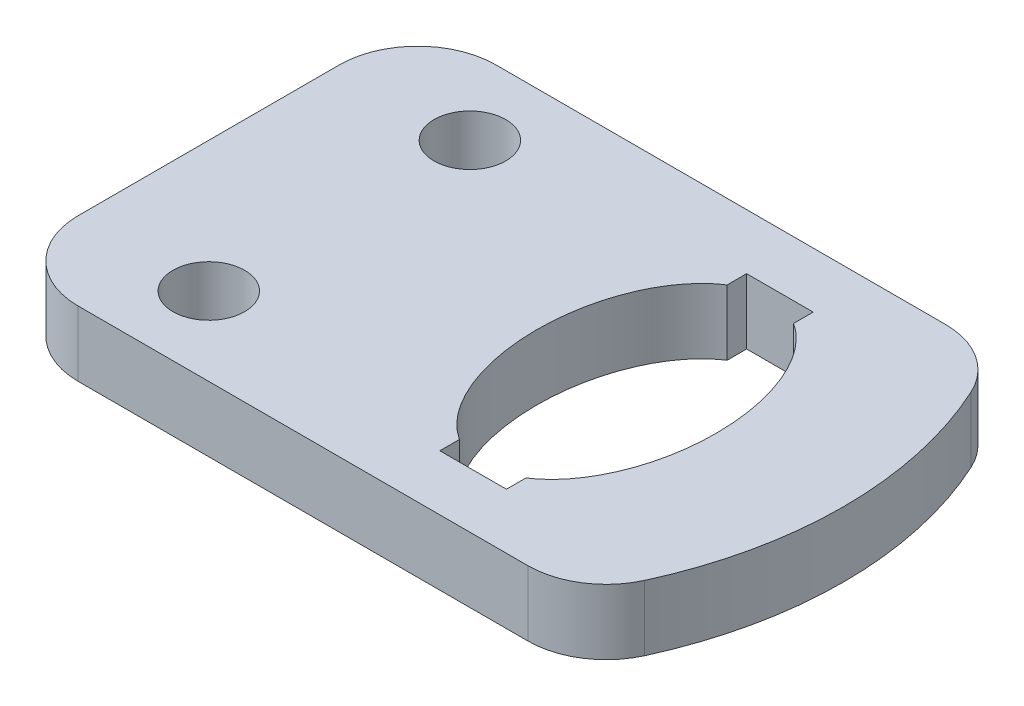
ISO-10303-21;
HEADER;
FILE_DESCRIPTION(('STEP AP214'),'2;1');
FILE_NAME('part.step','',(''),(''),'','','');
FILE_SCHEMA(('AUTOMOTIVE_DESIGN { 1 0 10303 214 1 1 1 1 }'));
ENDSEC;
DATA;
#1=APPLICATION_CONTEXT('core data for automotive mechanical design processes');
#2=APPLICATION_PROTOCOL_DEFINITION('international standard','automotive_design',2000,#1);
#3=PRODUCT_CONTEXT('',#1,'mechanical');
#4=PRODUCT('Part','Part','',(#3));
#5=PRODUCT_RELATED_PRODUCT_CATEGORY('part','',(#4));
#6=PRODUCT_DEFINITION_FORMATION('','',#4);
#7=PRODUCT_DEFINITION_CONTEXT('part definition',#1,'design');
#8=PRODUCT_DEFINITION('design','',#6,#7);
#9=PRODUCT_DEFINITION_SHAPE('','',#8);
#10=(LENGTH_UNIT() NAMED_UNIT(*) SI_UNIT(.MILLI.,.METRE.));
#11=(NAMED_UNIT(*) PLANE_ANGLE_UNIT() SI_UNIT($,.RADIAN.));
#12=(NAMED_UNIT(*) SI_UNIT($,.STERADIAN.) SOLID_ANGLE_UNIT());
#13=UNCERTAINTY_MEASURE_WITH_UNIT(LENGTH_MEASURE(1.E-05),#10,'distance_accuracy_value','');
#14=(GEOMETRIC_REPRESENTATION_CONTEXT(3) GLOBAL_UNCERTAINTY_ASSIGNED_CONTEXT((#13)) GLOBAL_UNIT_ASSIGNED_CONTEXT((#10,
#11,#12)) REPRESENTATION_CONTEXT('',''));
#15=CARTESIAN_POINT('',(0.,0.,0.));
#16=DIRECTION('',(0.,0.,1.));
#17=DIRECTION('',(1.,0.,0.));
#18=AXIS2_PLACEMENT_3D('',#15,#16,#17);
#19=CARTESIAN_POINT('',(44.,0.,32.));
#20=DIRECTION('',(0.,-1.,0.));
#21=DIRECTION('',(1.,0.,0.));
#22=AXIS2_PLACEMENT_3D('',#19,#20,#21);
#23=PLANE('',#22);
#24=CARTESIAN_POINT('',(10.,0.,6.));
#25=DIRECTION('',(0.,-1.,0.));
#26=DIRECTION('',(1.,0.,0.));
#27=AXIS2_PLACEMENT_3D('',#24,#25,#26);
#28=CIRCLE('',#27,2.75);
#29=CARTESIAN_POINT('',(12.75,0.,6.));
#30=VERTEX_POINT('',#29);
#31=EDGE_CURVE('E295',#30,#30,#28,.T.);
#32=ORIENTED_EDGE('',*,*,#31,.T.);
#33=EDGE_LOOP('',(#32));
#34=FACE_BOUND('',#33,.T.);
#35=CARTESIAN_POINT('',(10.,0.,26.));
#36=DIRECTION('',(0.,-1.,0.));
#37=DIRECTION('',(1.,0.,0.));
#38=AXIS2_PLACEMENT_3D('',#35,#36,#37);
#39=CIRCLE('',#38,2.75);
#40=CARTESIAN_POINT('',(12.75,0.,26.));
#41=VERTEX_POINT('',#40);
#42=EDGE_CURVE('E300',#41,#41,#39,.T.);
#43=ORIENTED_EDGE('',*,*,#42,.T.);
#44=EDGE_LOOP('',(#43));
#45=FACE_BOUND('',#44,.T.);
#46=DIRECTION('',(-1.,0.,0.));
#47=VECTOR('',#46,1.);
#48=CARTESIAN_POINT('',(29.45,0.,27.75));
#49=LINE('',#48,#47);
#50=CARTESIAN_POINT('',(34.55,0.,27.75));
#51=VERTEX_POINT('',#50);
#52=CARTESIAN_POINT('',(29.45,0.,27.75));
#53=VERTEX_POINT('',#52);
#54=EDGE_CURVE('E159',#51,#53,#49,.T.);
#55=ORIENTED_EDGE('',*,*,#54,.T.);
#56=DIRECTION('',(0.,0.,-1.));
#57=VECTOR('',#56,1.);
#58=CARTESIAN_POINT('',(29.45,0.,27.75));
#59=LINE('',#58,#57);
#60=CARTESIAN_POINT('',(29.45,0.,26.25));
#61=VERTEX_POINT('',#60);
#62=EDGE_CURVE('E151',#53,#61,#59,.T.);
#63=ORIENTED_EDGE('',*,*,#62,.T.);
#64=CARTESIAN_POINT('',(32.,0.,16.));
#65=DIRECTION('',(0.,-1.,0.));
#66=DIRECTION('',(0.,0.,1.));
#67=AXIS2_PLACEMENT_3D('',#64,#65,#66);
#68=ELLIPSE('',#67,11.0372996308849,6.87500000000001);
#69=CARTESIAN_POINT('',(29.45,0.,5.75));
#70=VERTEX_POINT('',#69);
#71=EDGE_CURVE('E163',#61,#70,#68,.T.);
#72=ORIENTED_EDGE('',*,*,#71,.T.);
#73=DIRECTION('',(0.,0.,-1.));
#74=VECTOR('',#73,1.);
#75=CARTESIAN_POINT('',(29.45,0.,5.75));
#76=LINE('',#75,#74);
#77=CARTESIAN_POINT('',(29.45,0.,4.25));
#78=VERTEX_POINT('',#77);
#79=EDGE_CURVE('E167',#70,#78,#76,.T.);
#80=ORIENTED_EDGE('',*,*,#79,.T.);
#81=DIRECTION('',(1.,0.,0.));
#82=VECTOR('',#81,1.);
#83=CARTESIAN_POINT('',(29.45,0.,4.25));
#84=LINE('',#83,#82);
#85=CARTESIAN_POINT('',(34.55,0.,4.25));
#86=VERTEX_POINT('',#85);
#87=EDGE_CURVE('E345',#78,#86,#84,.T.);
#88=ORIENTED_EDGE('',*,*,#87,.T.);
#89=DIRECTION('',(0.,0.,1.));
#90=VECTOR('',#89,1.);
#91=CARTESIAN_POINT('',(34.55,0.,5.75));
#92=LINE('',#91,#90);
#93=CARTESIAN_POINT('',(34.55,0.,5.74999999999999));
#94=VERTEX_POINT('',#93);
#95=EDGE_CURVE('E346',#86,#94,#92,.T.);
#96=ORIENTED_EDGE('',*,*,#95,.T.);
#97=CARTESIAN_POINT('',(32.,0.,16.));
#98=DIRECTION('',(0.,-1.,0.));
#99=DIRECTION('',(0.,0.,1.));
#100=AXIS2_PLACEMENT_3D('',#97,#98,#99);
#101=ELLIPSE('',#100,11.0372996308849,6.87500000000001);
#102=CARTESIAN_POINT('',(34.55,0.,26.25));
#103=VERTEX_POINT('',#102);
#104=EDGE_CURVE('E348',#94,#103,#101,.T.);
#105=ORIENTED_EDGE('',*,*,#104,.T.);
#106=DIRECTION('',(0.,0.,1.));
#107=VECTOR('',#106,1.);
#108=CARTESIAN_POINT('',(34.55,0.,27.75));
#109=LINE('',#108,#107);
#110=EDGE_CURVE('E354',#103,#51,#109,.T.);
#111=ORIENTED_EDGE('',*,*,#110,.T.);
#112=EDGE_LOOP('',(#55,#63,#72,#80,#88,#96,#105,#111));
#113=FACE_BOUND('',#112,.T.);
#114=CARTESIAN_POINT('',(18.622844919101,0.,16.));
#115=DIRECTION('',(0.,-1.,0.));
#116=DIRECTION('',(1.,0.,0.));
#117=AXIS2_PLACEMENT_3D('',#114,#115,#116);
#118=CIRCLE('',#117,30.);
#119=CARTESIAN_POINT('',(45.8946252056902,0.,28.5));
#120=VERTEX_POINT('',#119);
#121=CARTESIAN_POINT('',(45.8946252056902,0.,3.5));
#122=VERTEX_POINT('',#121);
#123=EDGE_CURVE('E287',#120,#122,#118,.F.);
#124=ORIENTED_EDGE('',*,*,#123,.T.);
#125=CARTESIAN_POINT('',(40.4402691483724,0.,6.));
#126=DIRECTION('',(0.,-1.,0.));
#127=DIRECTION('',(1.,0.,0.));
#128=AXIS2_PLACEMENT_3D('',#125,#126,#127);
#129=CIRCLE('',#128,6.);
#130=CARTESIAN_POINT('',(40.4402691483724,0.,0.));
#131=VERTEX_POINT('',#130);
#132=EDGE_CURVE('E235',#122,#131,#129,.F.);
#133=ORIENTED_EDGE('',*,*,#132,.T.);
#134=DIRECTION('',(-1.,0.,0.));
#135=VECTOR('',#134,1.);
#136=CARTESIAN_POINT('',(44.,0.,0.));
#137=LINE('',#136,#135);
#138=CARTESIAN_POINT('',(6.,0.,0.));
#139=VERTEX_POINT('',#138);
#140=EDGE_CURVE('E278',#131,#139,#137,.T.);
#141=ORIENTED_EDGE('',*,*,#140,.T.);
#142=CARTESIAN_POINT('',(6.,0.,6.));
#143=DIRECTION('',(0.,-1.,0.));
#144=DIRECTION('',(1.,0.,0.));
#145=AXIS2_PLACEMENT_3D('',#142,#143,#144);
#146=CIRCLE('',#145,6.);
#147=CARTESIAN_POINT('',(0.,0.,6.));
#148=VERTEX_POINT('',#147);
#149=EDGE_CURVE('E227',#139,#148,#146,.F.);
#150=ORIENTED_EDGE('',*,*,#149,.T.);
#151=DIRECTION('',(0.,0.,-1.));
#152=VECTOR('',#151,1.);
#153=CARTESIAN_POINT('',(0.,0.,32.));
#154=LINE('',#153,#152);
#155=CARTESIAN_POINT('',(0.,0.,26.));
#156=VERTEX_POINT('',#155);
#157=EDGE_CURVE('E257',#156,#148,#154,.T.);
#158=ORIENTED_EDGE('',*,*,#157,.F.);
#159=CARTESIAN_POINT('',(6.,0.,26.));
#160=DIRECTION('',(0.,-1.,0.));
#161=DIRECTION('',(1.,0.,0.));
#162=AXIS2_PLACEMENT_3D('',#159,#160,#161);
#163=CIRCLE('',#162,6.);
#164=CARTESIAN_POINT('',(6.,0.,32.));
#165=VERTEX_POINT('',#164);
#166=EDGE_CURVE('E233',#156,#165,#163,.F.);
#167=ORIENTED_EDGE('',*,*,#166,.T.);
#168=DIRECTION('',(-1.,0.,0.));
#169=VECTOR('',#168,1.);
#170=CARTESIAN_POINT('',(44.,0.,32.));
#171=LINE('',#170,#169);
#172=CARTESIAN_POINT('',(40.4402691483724,0.,32.));
#173=VERTEX_POINT('',#172);
#174=EDGE_CURVE('E269',#173,#165,#171,.T.);
#175=ORIENTED_EDGE('',*,*,#174,.F.);
#176=CARTESIAN_POINT('',(40.4402691483724,0.,26.));
#177=DIRECTION('',(0.,-1.,0.));
#178=DIRECTION('',(1.,0.,0.));
#179=AXIS2_PLACEMENT_3D('',#176,#177,#178);
#180=CIRCLE('',#179,6.);
#181=EDGE_CURVE('E232',#173,#120,#180,.F.);
#182=ORIENTED_EDGE('',*,*,#181,.T.);
#183=EDGE_LOOP('',(#124,#133,#141,#150,#158,#167,#175,#182));
#184=FACE_BOUND('',#183,.T.);
#185=ADVANCED_FACE('F33',(#34,#45,#113,#184),#23,.F.);
#186=CARTESIAN_POINT('',(0.,0.,32.));
#187=DIRECTION('',(1.,0.,0.));
#188=DIRECTION('',(0.,1.,0.));
#189=AXIS2_PLACEMENT_3D('',#186,#187,#188);
#190=PLANE('',#189);
#191=ORIENTED_EDGE('',*,*,#157,.T.);
#192=DIRECTION('',(0.,-1.,0.));
#193=VECTOR('',#192,1.);
#194=CARTESIAN_POINT('',(0.,0.,6.));
#195=LINE('',#194,#193);
#196=CARTESIAN_POINT('',(0.,-5.,6.));
#197=VERTEX_POINT('',#196);
#198=EDGE_CURVE('E11',#148,#197,#195,.T.);
#199=ORIENTED_EDGE('',*,*,#198,.T.);
#200=DIRECTION('',(0.,0.,-1.));
#201=VECTOR('',#200,1.);
#202=CARTESIAN_POINT('',(0.,-5.,32.));
#203=LINE('',#202,#201);
#204=CARTESIAN_POINT('',(0.,-5.,26.));
#205=VERTEX_POINT('',#204);
#206=EDGE_CURVE('E258',#205,#197,#203,.T.);
#207=ORIENTED_EDGE('',*,*,#206,.F.);
#208=DIRECTION('',(0.,-1.,0.));
#209=VECTOR('',#208,1.);
#210=CARTESIAN_POINT('',(0.,0.,26.));
#211=LINE('',#210,#209);
#212=EDGE_CURVE('E41',#205,#156,#211,.F.);
#213=ORIENTED_EDGE('',*,*,#212,.T.);
#214=EDGE_LOOP('',(#191,#199,#207,#213));
#215=FACE_BOUND('',#214,.T.);
#216=ADVANCED_FACE('F204',(#215),#190,.F.);
#217=CARTESIAN_POINT('',(0.,-5.,32.));
#218=DIRECTION('',(0.,1.,0.));
#219=DIRECTION('',(0.,0.,1.));
#220=AXIS2_PLACEMENT_3D('',#217,#218,#219);
#221=PLANE('',#220);
#222=CARTESIAN_POINT('',(10.,-5.,6.));
#223=DIRECTION('',(0.,-1.,0.));
#224=DIRECTION('',(1.,0.,0.));
#225=AXIS2_PLACEMENT_3D('',#222,#223,#224);
#226=CIRCLE('',#225,2.75);
#227=CARTESIAN_POINT('',(12.75,-5.,6.));
#228=VERTEX_POINT('',#227);
#229=EDGE_CURVE('E292',#228,#228,#226,.T.);
#230=ORIENTED_EDGE('',*,*,#229,.F.);
#231=EDGE_LOOP('',(#230));
#232=FACE_BOUND('',#231,.T.);
#233=CARTESIAN_POINT('',(10.,-5.,26.));
#234=DIRECTION('',(0.,-1.,0.));
#235=DIRECTION('',(1.,0.,0.));
#236=AXIS2_PLACEMENT_3D('',#233,#234,#235);
#237=CIRCLE('',#236,2.75);
#238=CARTESIAN_POINT('',(12.75,-5.,26.));
#239=VERTEX_POINT('',#238);
#240=EDGE_CURVE('E178',#239,#239,#237,.T.);
#241=ORIENTED_EDGE('',*,*,#240,.F.);
#242=EDGE_LOOP('',(#241));
#243=FACE_BOUND('',#242,.T.);
#244=CARTESIAN_POINT('',(32.,-5.,16.));
#245=DIRECTION('',(0.,-1.,0.));
#246=DIRECTION('',(0.,0.,1.));
#247=AXIS2_PLACEMENT_3D('',#244,#245,#246);
#248=ELLIPSE('',#247,11.0372996308849,6.87500000000001);
#249=CARTESIAN_POINT('',(29.45,-5.,26.25));
#250=VERTEX_POINT('',#249);
#251=CARTESIAN_POINT('',(29.45,-5.,5.75));
#252=VERTEX_POINT('',#251);
#253=EDGE_CURVE('E304',#250,#252,#248,.T.);
#254=ORIENTED_EDGE('',*,*,#253,.F.);
#255=DIRECTION('',(0.,0.,-1.));
#256=VECTOR('',#255,1.);
#257=CARTESIAN_POINT('',(29.45,-5.,27.75));
#258=LINE('',#257,#256);
#259=CARTESIAN_POINT('',(29.45,-5.,27.75));
#260=VERTEX_POINT('',#259);
#261=EDGE_CURVE('E154',#260,#250,#258,.T.);
#262=ORIENTED_EDGE('',*,*,#261,.F.);
#263=DIRECTION('',(-1.,0.,0.));
#264=VECTOR('',#263,1.);
#265=CARTESIAN_POINT('',(29.45,-5.,27.75));
#266=LINE('',#265,#264);
#267=CARTESIAN_POINT('',(34.55,-5.,27.75));
#268=VERTEX_POINT('',#267);
#269=EDGE_CURVE('E172',#268,#260,#266,.T.);
#270=ORIENTED_EDGE('',*,*,#269,.F.);
#271=DIRECTION('',(0.,0.,1.));
#272=VECTOR('',#271,1.);
#273=CARTESIAN_POINT('',(34.55,-5.,27.75));
#274=LINE('',#273,#272);
#275=CARTESIAN_POINT('',(34.55,-5.,26.25));
#276=VERTEX_POINT('',#275);
#277=EDGE_CURVE('E175',#276,#268,#274,.T.);
#278=ORIENTED_EDGE('',*,*,#277,.F.);
#279=CARTESIAN_POINT('',(32.,-5.,16.));
#280=DIRECTION('',(0.,-1.,0.));
#281=DIRECTION('',(0.,0.,1.));
#282=AXIS2_PLACEMENT_3D('',#279,#280,#281);
#283=ELLIPSE('',#282,11.0372996308849,6.87500000000001);
#284=CARTESIAN_POINT('',(34.55,-5.,5.74999999999999));
#285=VERTEX_POINT('',#284);
#286=EDGE_CURVE('E326',#285,#276,#283,.T.);
#287=ORIENTED_EDGE('',*,*,#286,.F.);
#288=DIRECTION('',(0.,0.,1.));
#289=VECTOR('',#288,1.);
#290=CARTESIAN_POINT('',(34.55,-5.,5.75));
#291=LINE('',#290,#289);
#292=CARTESIAN_POINT('',(34.55,-5.,4.25));
#293=VERTEX_POINT('',#292);
#294=EDGE_CURVE('E323',#293,#285,#291,.T.);
#295=ORIENTED_EDGE('',*,*,#294,.F.);
#296=DIRECTION('',(1.,0.,0.));
#297=VECTOR('',#296,1.);
#298=CARTESIAN_POINT('',(29.45,-5.,4.25));
#299=LINE('',#298,#297);
#300=CARTESIAN_POINT('',(29.45,-5.,4.25));
#301=VERTEX_POINT('',#300);
#302=EDGE_CURVE('E317',#301,#293,#299,.T.);
#303=ORIENTED_EDGE('',*,*,#302,.F.);
#304=DIRECTION('',(0.,0.,-1.));
#305=VECTOR('',#304,1.);
#306=CARTESIAN_POINT('',(29.45,-5.,5.75));
#307=LINE('',#306,#305);
#308=EDGE_CURVE('E315',#252,#301,#307,.T.);
#309=ORIENTED_EDGE('',*,*,#308,.F.);
#310=EDGE_LOOP('',(#254,#262,#270,#278,#287,#295,#303,#309));
#311=FACE_BOUND('',#310,.T.);
#312=DIRECTION('',(1.,0.,0.));
#313=VECTOR('',#312,1.);
#314=CARTESIAN_POINT('',(0.,-5.,0.));
#315=LINE('',#314,#313);
#316=CARTESIAN_POINT('',(6.,-5.,0.));
#317=VERTEX_POINT('',#316);
#318=CARTESIAN_POINT('',(40.4402691483724,-5.,0.));
#319=VERTEX_POINT('',#318);
#320=EDGE_CURVE('E275',#317,#319,#315,.T.);
#321=ORIENTED_EDGE('',*,*,#320,.T.);
#322=CARTESIAN_POINT('',(40.4402691483724,-5.,6.));
#323=DIRECTION('',(0.,1.,0.));
#324=DIRECTION('',(0.,0.,1.));
#325=AXIS2_PLACEMENT_3D('',#322,#323,#324);
#326=CIRCLE('',#325,6.);
#327=CARTESIAN_POINT('',(45.8946252056902,-5.,3.5));
#328=VERTEX_POINT('',#327);
#329=EDGE_CURVE('E249',#319,#328,#326,.F.);
#330=ORIENTED_EDGE('',*,*,#329,.T.);
#331=CARTESIAN_POINT('',(18.622844919101,-5.,16.));
#332=DIRECTION('',(0.,-1.,0.));
#333=DIRECTION('',(0.,0.,-1.));
#334=AXIS2_PLACEMENT_3D('',#331,#332,#333);
#335=CIRCLE('',#334,30.);
#336=CARTESIAN_POINT('',(45.8946252056902,-5.,28.5));
#337=VERTEX_POINT('',#336);
#338=EDGE_CURVE('E289',#328,#337,#335,.T.);
#339=ORIENTED_EDGE('',*,*,#338,.T.);
#340=CARTESIAN_POINT('',(40.4402691483724,-5.,26.));
#341=DIRECTION('',(0.,1.,0.));
#342=DIRECTION('',(0.,0.,1.));
#343=AXIS2_PLACEMENT_3D('',#340,#341,#342);
#344=CIRCLE('',#343,6.);
#345=CARTESIAN_POINT('',(40.4402691483724,-5.,32.));
#346=VERTEX_POINT('',#345);
#347=EDGE_CURVE('E247',#337,#346,#344,.F.);
#348=ORIENTED_EDGE('',*,*,#347,.T.);
#349=DIRECTION('',(1.,0.,0.));
#350=VECTOR('',#349,1.);
#351=CARTESIAN_POINT('',(0.,-5.,32.));
#352=LINE('',#351,#350);
#353=CARTESIAN_POINT('',(6.,-5.,32.));
#354=VERTEX_POINT('',#353);
#355=EDGE_CURVE('E267',#354,#346,#352,.T.);
#356=ORIENTED_EDGE('',*,*,#355,.F.);
#357=CARTESIAN_POINT('',(6.,-5.,26.));
#358=DIRECTION('',(0.,1.,0.));
#359=DIRECTION('',(0.,0.,1.));
#360=AXIS2_PLACEMENT_3D('',#357,#358,#359);
#361=CIRCLE('',#360,6.);
#362=EDGE_CURVE('E55',#354,#205,#361,.F.);
#363=ORIENTED_EDGE('',*,*,#362,.T.);
#364=ORIENTED_EDGE('',*,*,#206,.T.);
#365=CARTESIAN_POINT('',(6.,-5.,6.));
#366=DIRECTION('',(0.,1.,0.));
#367=DIRECTION('',(0.,0.,1.));
#368=AXIS2_PLACEMENT_3D('',#365,#366,#367);
#369=CIRCLE('',#368,6.);
#370=EDGE_CURVE('E48',#197,#317,#369,.F.);
#371=ORIENTED_EDGE('',*,*,#370,.T.);
#372=EDGE_LOOP('',(#321,#330,#339,#348,#356,#363,#364,#371));
#373=FACE_BOUND('',#372,.T.);
#374=ADVANCED_FACE('F197',(#232,#243,#311,#373),#221,.F.);
#375=CARTESIAN_POINT('',(44.,0.,32.));
#376=DIRECTION('',(0.,0.,1.));
#377=DIRECTION('',(1.,0.,0.));
#378=AXIS2_PLACEMENT_3D('',#375,#376,#377);
#379=PLANE('',#378);
#380=ORIENTED_EDGE('',*,*,#355,.T.);
#381=DIRECTION('',(0.,-1.,0.));
#382=VECTOR('',#381,1.);
#383=CARTESIAN_POINT('',(40.4402691483724,0.,32.));
#384=LINE('',#383,#382);
#385=EDGE_CURVE('E254',#346,#173,#384,.F.);
#386=ORIENTED_EDGE('',*,*,#385,.T.);
#387=ORIENTED_EDGE('',*,*,#174,.T.);
#388=DIRECTION('',(0.,-1.,0.));
#389=VECTOR('',#388,1.);
#390=CARTESIAN_POINT('',(6.,-5.,32.));
#391=LINE('',#390,#389);
#392=EDGE_CURVE('E251',#165,#354,#391,.T.);
#393=ORIENTED_EDGE('',*,*,#392,.T.);
#394=EDGE_LOOP('',(#380,#386,#387,#393));
#395=FACE_BOUND('',#394,.T.);
#396=ADVANCED_FACE('F194',(#395),#379,.T.);
#397=CARTESIAN_POINT('',(44.,0.,0.));
#398=DIRECTION('',(0.,0.,1.));
#399=DIRECTION('',(1.,0.,0.));
#400=AXIS2_PLACEMENT_3D('',#397,#398,#399);
#401=PLANE('',#400);
#402=ORIENTED_EDGE('',*,*,#140,.F.);
#403=DIRECTION('',(0.,1.,0.));
#404=VECTOR('',#403,1.);
#405=CARTESIAN_POINT('',(40.4402691483724,-5.,0.));
#406=LINE('',#405,#404);
#407=EDGE_CURVE('E243',#131,#319,#406,.F.);
#408=ORIENTED_EDGE('',*,*,#407,.T.);
#409=ORIENTED_EDGE('',*,*,#320,.F.);
#410=DIRECTION('',(0.,-1.,0.));
#411=VECTOR('',#410,1.);
#412=CARTESIAN_POINT('',(6.,0.,0.));
#413=LINE('',#412,#411);
#414=EDGE_CURVE('E228',#317,#139,#413,.F.);
#415=ORIENTED_EDGE('',*,*,#414,.T.);
#416=EDGE_LOOP('',(#402,#408,#409,#415));
#417=FACE_BOUND('',#416,.T.);
#418=ADVANCED_FACE('F193',(#417),#401,.F.);
#419=CARTESIAN_POINT('',(29.45,0.,27.75));
#420=DIRECTION('',(-1.,0.,0.));
#421=DIRECTION('',(0.,-1.,0.));
#422=AXIS2_PLACEMENT_3D('',#419,#420,#421);
#423=PLANE('',#422);
#424=ORIENTED_EDGE('',*,*,#261,.T.);
#425=DIRECTION('',(0.,-1.,0.));
#426=VECTOR('',#425,1.);
#427=CARTESIAN_POINT('',(29.45,0.,26.25));
#428=LINE('',#427,#426);
#429=EDGE_CURVE('E147',#61,#250,#428,.T.);
#430=ORIENTED_EDGE('',*,*,#429,.F.);
#431=ORIENTED_EDGE('',*,*,#62,.F.);
#432=DIRECTION('',(0.,-1.,0.));
#433=VECTOR('',#432,1.);
#434=CARTESIAN_POINT('',(29.45,0.,27.75));
#435=LINE('',#434,#433);
#436=EDGE_CURVE('E280',#53,#260,#435,.T.);
#437=ORIENTED_EDGE('',*,*,#436,.T.);
#438=EDGE_LOOP('',(#424,#430,#431,#437));
#439=FACE_BOUND('',#438,.T.);
#440=ADVANCED_FACE('F149',(#439),#423,.F.);
#441=CARTESIAN_POINT('',(29.45,0.,27.75));
#442=DIRECTION('',(0.,0.,1.));
#443=DIRECTION('',(1.,0.,0.));
#444=AXIS2_PLACEMENT_3D('',#441,#442,#443);
#445=PLANE('',#444);
#446=ORIENTED_EDGE('',*,*,#269,.T.);
#447=ORIENTED_EDGE('',*,*,#436,.F.);
#448=ORIENTED_EDGE('',*,*,#54,.F.);
#449=DIRECTION('',(0.,-1.,0.));
#450=VECTOR('',#449,1.);
#451=CARTESIAN_POINT('',(34.55,0.,27.75));
#452=LINE('',#451,#450);
#453=EDGE_CURVE('E332',#51,#268,#452,.T.);
#454=ORIENTED_EDGE('',*,*,#453,.T.);
#455=EDGE_LOOP('',(#446,#447,#448,#454));
#456=FACE_BOUND('',#455,.T.);
#457=ADVANCED_FACE('F192',(#456),#445,.F.);
#458=CARTESIAN_POINT('',(34.55,0.,27.75));
#459=DIRECTION('',(1.,0.,0.));
#460=DIRECTION('',(0.,1.,0.));
#461=AXIS2_PLACEMENT_3D('',#458,#459,#460);
#462=PLANE('',#461);
#463=ORIENTED_EDGE('',*,*,#277,.T.);
#464=ORIENTED_EDGE('',*,*,#453,.F.);
#465=ORIENTED_EDGE('',*,*,#110,.F.);
#466=DIRECTION('',(0.,-1.,0.));
#467=VECTOR('',#466,1.);
#468=CARTESIAN_POINT('',(34.55,0.,26.25));
#469=LINE('',#468,#467);
#470=EDGE_CURVE('E334',#103,#276,#469,.T.);
#471=ORIENTED_EDGE('',*,*,#470,.T.);
#472=EDGE_LOOP('',(#463,#464,#465,#471));
#473=FACE_BOUND('',#472,.T.);
#474=ADVANCED_FACE('F361',(#473),#462,.F.);
#475=DIRECTION('',(0.,-1.,0.));
#476=VECTOR('',#475,1.);
#477=SURFACE_OF_LINEAR_EXTRUSION('',#101,#476);
#478=ORIENTED_EDGE('',*,*,#286,.T.);
#479=ORIENTED_EDGE('',*,*,#470,.F.);
#480=ORIENTED_EDGE('',*,*,#104,.F.);
#481=DIRECTION('',(0.,-1.,0.));
#482=VECTOR('',#481,1.);
#483=CARTESIAN_POINT('',(34.55,0.,5.74999999999999));
#484=LINE('',#483,#482);
#485=EDGE_CURVE('E336',#94,#285,#484,.T.);
#486=ORIENTED_EDGE('',*,*,#485,.T.);
#487=EDGE_LOOP('',(#478,#479,#480,#486));
#488=FACE_BOUND('',#487,.T.);
#489=ADVANCED_FACE('F356',(#488),#477,.F.);
#490=CARTESIAN_POINT('',(34.55,0.,5.75));
#491=DIRECTION('',(1.,0.,0.));
#492=DIRECTION('',(0.,1.,0.));
#493=AXIS2_PLACEMENT_3D('',#490,#491,#492);
#494=PLANE('',#493);
#495=ORIENTED_EDGE('',*,*,#294,.T.);
#496=ORIENTED_EDGE('',*,*,#485,.F.);
#497=ORIENTED_EDGE('',*,*,#95,.F.);
#498=DIRECTION('',(0.,-1.,0.));
#499=VECTOR('',#498,1.);
#500=CARTESIAN_POINT('',(34.55,0.,4.25));
#501=LINE('',#500,#499);
#502=EDGE_CURVE('E338',#86,#293,#501,.T.);
#503=ORIENTED_EDGE('',*,*,#502,.T.);
#504=EDGE_LOOP('',(#495,#496,#497,#503));
#505=FACE_BOUND('',#504,.T.);
#506=ADVANCED_FACE('F360',(#505),#494,.F.);
#507=CARTESIAN_POINT('',(29.45,0.,4.25));
#508=DIRECTION('',(0.,0.,-1.));
#509=DIRECTION('',(-1.,0.,0.));
#510=AXIS2_PLACEMENT_3D('',#507,#508,#509);
#511=PLANE('',#510);
#512=ORIENTED_EDGE('',*,*,#302,.T.);
#513=ORIENTED_EDGE('',*,*,#502,.F.);
#514=ORIENTED_EDGE('',*,*,#87,.F.);
#515=DIRECTION('',(0.,-1.,0.));
#516=VECTOR('',#515,1.);
#517=CARTESIAN_POINT('',(29.45,0.,4.25));
#518=LINE('',#517,#516);
#519=EDGE_CURVE('E340',#78,#301,#518,.T.);
#520=ORIENTED_EDGE('',*,*,#519,.T.);
#521=EDGE_LOOP('',(#512,#513,#514,#520));
#522=FACE_BOUND('',#521,.T.);
#523=ADVANCED_FACE('F365',(#522),#511,.F.);
#524=CARTESIAN_POINT('',(29.45,0.,5.75));
#525=DIRECTION('',(-1.,0.,0.));
#526=DIRECTION('',(0.,-1.,0.));
#527=AXIS2_PLACEMENT_3D('',#524,#525,#526);
#528=PLANE('',#527);
#529=ORIENTED_EDGE('',*,*,#308,.T.);
#530=ORIENTED_EDGE('',*,*,#519,.F.);
#531=ORIENTED_EDGE('',*,*,#79,.F.);
#532=DIRECTION('',(0.,-1.,0.));
#533=VECTOR('',#532,1.);
#534=CARTESIAN_POINT('',(29.45,0.,5.75));
#535=LINE('',#534,#533);
#536=EDGE_CURVE('E158',#70,#252,#535,.T.);
#537=ORIENTED_EDGE('',*,*,#536,.T.);
#538=EDGE_LOOP('',(#529,#530,#531,#537));
#539=FACE_BOUND('',#538,.T.);
#540=ADVANCED_FACE('F188',(#539),#528,.F.);
#541=DIRECTION('',(0.,-1.,0.));
#542=VECTOR('',#541,1.);
#543=SURFACE_OF_LINEAR_EXTRUSION('',#68,#542);
#544=ORIENTED_EDGE('',*,*,#253,.T.);
#545=ORIENTED_EDGE('',*,*,#536,.F.);
#546=ORIENTED_EDGE('',*,*,#71,.F.);
#547=ORIENTED_EDGE('',*,*,#429,.T.);
#548=EDGE_LOOP('',(#544,#545,#546,#547));
#549=FACE_BOUND('',#548,.T.);
#550=ADVANCED_FACE('F164',(#549),#543,.F.);
#551=CARTESIAN_POINT('',(10.,0.,26.));
#552=DIRECTION('',(0.,-1.,0.));
#553=DIRECTION('',(1.,0.,0.));
#554=AXIS2_PLACEMENT_3D('',#551,#552,#553);
#555=CYLINDRICAL_SURFACE('',#554,2.75);
#556=ORIENTED_EDGE('',*,*,#42,.F.);
#557=EDGE_LOOP('',(#556));
#558=FACE_BOUND('',#557,.T.);
#559=ORIENTED_EDGE('',*,*,#240,.T.);
#560=EDGE_LOOP('',(#559));
#561=FACE_BOUND('',#560,.T.);
#562=ADVANCED_FACE('F187',(#558,#561),#555,.F.);
#563=CARTESIAN_POINT('',(10.,0.,6.));
#564=DIRECTION('',(0.,-1.,0.));
#565=DIRECTION('',(1.,0.,0.));
#566=AXIS2_PLACEMENT_3D('',#563,#564,#565);
#567=CYLINDRICAL_SURFACE('',#566,2.75);
#568=ORIENTED_EDGE('',*,*,#31,.F.);
#569=EDGE_LOOP('',(#568));
#570=FACE_BOUND('',#569,.T.);
#571=ORIENTED_EDGE('',*,*,#229,.T.);
#572=EDGE_LOOP('',(#571));
#573=FACE_BOUND('',#572,.T.);
#574=ADVANCED_FACE('F387',(#570,#573),#567,.F.);
#575=CARTESIAN_POINT('',(18.622844919101,32.3321928601519,16.));
#576=DIRECTION('',(0.,-1.,0.));
#577=DIRECTION('',(0.,0.,-1.));
#578=AXIS2_PLACEMENT_3D('',#575,#576,#577);
#579=CYLINDRICAL_SURFACE('',#578,30.);
#580=ORIENTED_EDGE('',*,*,#338,.F.);
#581=DIRECTION('',(0.,-1.,0.));
#582=VECTOR('',#581,1.);
#583=CARTESIAN_POINT('',(45.8946252056903,32.3321928601519,3.49999999999999));
#584=LINE('',#583,#582);
#585=EDGE_CURVE('E237',#328,#122,#584,.F.);
#586=ORIENTED_EDGE('',*,*,#585,.T.);
#587=ORIENTED_EDGE('',*,*,#123,.F.);
#588=DIRECTION('',(0.,-1.,0.));
#589=VECTOR('',#588,1.);
#590=CARTESIAN_POINT('',(45.8946252056903,32.3321928601519,28.5));
#591=LINE('',#590,#589);
#592=EDGE_CURVE('E263',#120,#337,#591,.T.);
#593=ORIENTED_EDGE('',*,*,#592,.T.);
#594=EDGE_LOOP('',(#580,#586,#587,#593));
#595=FACE_BOUND('',#594,.T.);
#596=ADVANCED_FACE('F216',(#595),#579,.T.);
#597=CARTESIAN_POINT('',(40.4402691483724,32.3321928601519,6.));
#598=DIRECTION('',(0.,-1.,0.));
#599=DIRECTION('',(0.,0.,-1.));
#600=AXIS2_PLACEMENT_3D('',#597,#598,#599);
#601=CYLINDRICAL_SURFACE('',#600,6.);
#602=ORIENTED_EDGE('',*,*,#329,.F.);
#603=ORIENTED_EDGE('',*,*,#407,.F.);
#604=ORIENTED_EDGE('',*,*,#132,.F.);
#605=ORIENTED_EDGE('',*,*,#585,.F.);
#606=EDGE_LOOP('',(#602,#603,#604,#605));
#607=FACE_BOUND('',#606,.T.);
#608=ADVANCED_FACE('F212',(#607),#601,.T.);
#609=CARTESIAN_POINT('',(40.4402691483724,32.3321928601519,26.));
#610=DIRECTION('',(0.,-1.,0.));
#611=DIRECTION('',(0.,0.,-1.));
#612=AXIS2_PLACEMENT_3D('',#609,#610,#611);
#613=CYLINDRICAL_SURFACE('',#612,6.);
#614=ORIENTED_EDGE('',*,*,#347,.F.);
#615=ORIENTED_EDGE('',*,*,#592,.F.);
#616=ORIENTED_EDGE('',*,*,#181,.F.);
#617=ORIENTED_EDGE('',*,*,#385,.F.);
#618=EDGE_LOOP('',(#614,#615,#616,#617));
#619=FACE_BOUND('',#618,.T.);
#620=ADVANCED_FACE('F215',(#619),#613,.T.);
#621=CARTESIAN_POINT('',(6.,0.,6.));
#622=DIRECTION('',(0.,-1.,0.));
#623=DIRECTION('',(1.,0.,0.));
#624=AXIS2_PLACEMENT_3D('',#621,#622,#623);
#625=CYLINDRICAL_SURFACE('',#624,6.);
#626=ORIENTED_EDGE('',*,*,#149,.F.);
#627=ORIENTED_EDGE('',*,*,#414,.F.);
#628=ORIENTED_EDGE('',*,*,#370,.F.);
#629=ORIENTED_EDGE('',*,*,#198,.F.);
#630=EDGE_LOOP('',(#626,#627,#628,#629));
#631=FACE_BOUND('',#630,.T.);
#632=ADVANCED_FACE('F219',(#631),#625,.T.);
#633=CARTESIAN_POINT('',(6.,0.,26.));
#634=DIRECTION('',(0.,1.,0.));
#635=DIRECTION('',(-1.,0.,0.));
#636=AXIS2_PLACEMENT_3D('',#633,#634,#635);
#637=CYLINDRICAL_SURFACE('',#636,6.);
#638=ORIENTED_EDGE('',*,*,#166,.F.);
#639=ORIENTED_EDGE('',*,*,#212,.F.);
#640=ORIENTED_EDGE('',*,*,#362,.F.);
#641=ORIENTED_EDGE('',*,*,#392,.F.);
#642=EDGE_LOOP('',(#638,#639,#640,#641));
#643=FACE_BOUND('',#642,.T.);
#644=ADVANCED_FACE('F35',(#643),#637,.T.);
#645=CLOSED_SHELL('',(#185,#216,#374,#396,#418,#440,#457,#474,#489,#506,#523,#540,#550,#562,
#574,#596,#608,#620,#632,#644));
#646=MANIFOLD_SOLID_BREP('B2',#645);
#647=ADVANCED_BREP_SHAPE_REPRESENTATION('',(#18,#646),#14);
#648=SHAPE_DEFINITION_REPRESENTATION(#9,#647);
ENDSEC;
END-ISO-10303-21;
